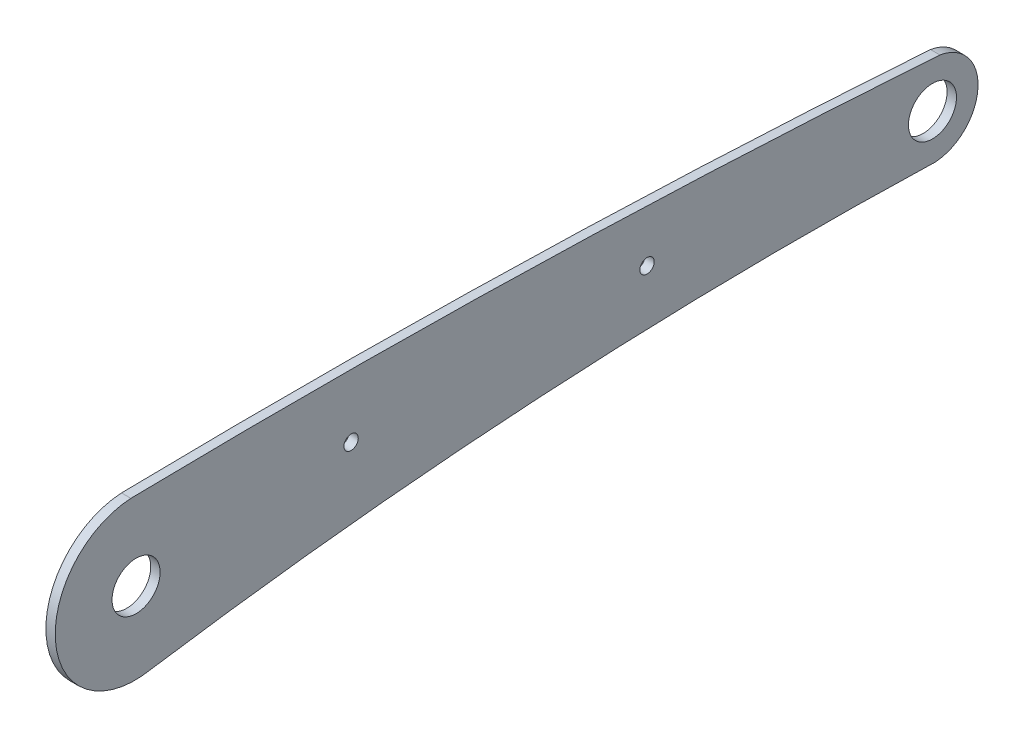
ISO-10303-21;
HEADER;
FILE_DESCRIPTION(('STEP AP214'),'2;1');
FILE_NAME('part.step','',(''),(''),'','','');
FILE_SCHEMA(('AUTOMOTIVE_DESIGN { 1 0 10303 214 1 1 1 1 }'));
ENDSEC;
DATA;
#1=APPLICATION_CONTEXT('core data for automotive mechanical design processes');
#2=APPLICATION_PROTOCOL_DEFINITION('international standard','automotive_design',2000,#1);
#3=PRODUCT_CONTEXT('',#1,'mechanical');
#4=PRODUCT('Part','Part','',(#3));
#5=PRODUCT_RELATED_PRODUCT_CATEGORY('part','',(#4));
#6=PRODUCT_DEFINITION_FORMATION('','',#4);
#7=PRODUCT_DEFINITION_CONTEXT('part definition',#1,'design');
#8=PRODUCT_DEFINITION('design','',#6,#7);
#9=PRODUCT_DEFINITION_SHAPE('','',#8);
#10=(LENGTH_UNIT() NAMED_UNIT(*) SI_UNIT(.MILLI.,.METRE.));
#11=(NAMED_UNIT(*) PLANE_ANGLE_UNIT() SI_UNIT($,.RADIAN.));
#12=(NAMED_UNIT(*) SI_UNIT($,.STERADIAN.) SOLID_ANGLE_UNIT());
#13=UNCERTAINTY_MEASURE_WITH_UNIT(LENGTH_MEASURE(1.E-05),#10,'distance_accuracy_value','');
#14=(GEOMETRIC_REPRESENTATION_CONTEXT(3) GLOBAL_UNCERTAINTY_ASSIGNED_CONTEXT((#13)) GLOBAL_UNIT_ASSIGNED_CONTEXT((#10,
#11,#12)) REPRESENTATION_CONTEXT('',''));
#15=CARTESIAN_POINT('',(0.,0.,0.));
#16=DIRECTION('',(0.,0.,1.));
#17=DIRECTION('',(1.,0.,0.));
#18=AXIS2_PLACEMENT_3D('',#15,#16,#17);
#19=CARTESIAN_POINT('',(1.5,0.0065204226326564,-66.7586301230406));
#20=DIRECTION('',(1.,0.,0.));
#21=DIRECTION('',(0.,0.,-1.));
#22=AXIS2_PLACEMENT_3D('',#19,#20,#21);
#23=PLANE('',#22);
#24=CARTESIAN_POINT('',(1.5,3.57117752441619,-20.8921029200437));
#25=DIRECTION('',(1.,0.,0.));
#26=DIRECTION('',(0.,0.,-1.));
#27=AXIS2_PLACEMENT_3D('',#24,#25,#26);
#28=CIRCLE('',#27,1.14903100774873);
#29=CARTESIAN_POINT('',(1.5,3.57117752441619,-22.0411339277924));
#30=VERTEX_POINT('',#29);
#31=EDGE_CURVE('E172',#30,#30,#28,.T.);
#32=ORIENTED_EDGE('',*,*,#31,.F.);
#33=EDGE_LOOP('',(#32));
#34=FACE_BOUND('',#33,.T.);
#35=CARTESIAN_POINT('',(1.5,2.1615708798249,-66.6171405395635));
#36=DIRECTION('',(1.,0.,0.));
#37=DIRECTION('',(0.,0.,-1.));
#38=AXIS2_PLACEMENT_3D('',#35,#36,#37);
#39=CIRCLE('',#38,3.85000000000001);
#40=CARTESIAN_POINT('',(1.5,2.1615708798249,-70.4671405395635));
#41=VERTEX_POINT('',#40);
#42=EDGE_CURVE('E112',#41,#41,#39,.T.);
#43=ORIENTED_EDGE('',*,*,#42,.F.);
#44=EDGE_LOOP('',(#43));
#45=FACE_BOUND('',#44,.T.);
#46=CARTESIAN_POINT('',(1.5,-2.14853003455959,-66.9001197065177));
#47=DIRECTION('',(1.,0.,0.));
#48=DIRECTION('',(0.,0.,-1.));
#49=AXIS2_PLACEMENT_3D('',#46,#47,#48);
#50=CIRCLE('',#49,2.9844961240227);
#51=CARTESIAN_POINT('',(1.5,-5.11662723586404,-66.5876839244522));
#52=VERTEX_POINT('',#51);
#53=CARTESIAN_POINT('',(1.5,-5.12661444963508,-67.095645487384));
#54=VERTEX_POINT('',#53);
#55=EDGE_CURVE('E117',#52,#54,#50,.T.);
#56=ORIENTED_EDGE('',*,*,#55,.T.);
#57=CARTESIAN_POINT('',(1.5,2.1615708798249,-66.6171405395635));
#58=DIRECTION('',(1.,0.,0.));
#59=DIRECTION('',(0.,0.,-1.));
#60=AXIS2_PLACEMENT_3D('',#57,#58,#59);
#61=CIRCLE('',#60,7.30387653110624);
#62=CARTESIAN_POINT('',(1.5,9.36927454105452,-67.7985042911333));
#63=VERTEX_POINT('',#62);
#64=EDGE_CURVE('E84',#54,#63,#61,.T.);
#65=ORIENTED_EDGE('',*,*,#64,.T.);
#66=CARTESIAN_POINT('',(1.5,-1440.36136953038,33.8038491519962));
#67=DIRECTION('',(1.,0.,0.));
#68=DIRECTION('',(0.,0.,-1.));
#69=AXIS2_PLACEMENT_3D('',#66,#67,#68);
#70=CIRCLE('',#69,1453.28661267658);
#71=CARTESIAN_POINT('',(1.5,12.6554814310781,61.8040171337543));
#72=VERTEX_POINT('',#71);
#73=EDGE_CURVE('E88',#63,#72,#70,.T.);
#74=ORIENTED_EDGE('',*,*,#73,.T.);
#75=CARTESIAN_POINT('',(1.5,-0.125777128901056,61.1215510533747));
#76=DIRECTION('',(1.,0.,0.));
#77=DIRECTION('',(0.,0.,-1.));
#78=AXIS2_PLACEMENT_3D('',#75,#76,#77);
#79=CIRCLE('',#78,12.7994660172957);
#80=CARTESIAN_POINT('',(1.5,-12.681082443716,58.6334516221455));
#81=VERTEX_POINT('',#80);
#82=EDGE_CURVE('E92',#72,#81,#79,.T.);
#83=ORIENTED_EDGE('',*,*,#82,.T.);
#84=CARTESIAN_POINT('',(1.5,-695.689726778049,-45.4653103386699));
#85=DIRECTION('',(-1.,0.,0.));
#86=DIRECTION('',(0.,0.,-1.));
#87=AXIS2_PLACEMENT_3D('',#84,#85,#86);
#88=CIRCLE('',#87,690.896056203245);
#89=EDGE_CURVE('E50',#81,#52,#88,.T.);
#90=ORIENTED_EDGE('',*,*,#89,.T.);
#91=EDGE_LOOP('',(#56,#65,#74,#83,#90));
#92=FACE_BOUND('',#91,.T.);
#93=CARTESIAN_POINT('',(1.5,0.0795854792217612,60.9696633130141));
#94=DIRECTION('',(1.,0.,0.));
#95=DIRECTION('',(0.,0.,-1.));
#96=AXIS2_PLACEMENT_3D('',#93,#94,#95);
#97=CIRCLE('',#96,3.85);
#98=CARTESIAN_POINT('',(1.5,0.0795854792217612,57.1196633130141));
#99=VERTEX_POINT('',#98);
#100=EDGE_CURVE('E178',#99,#99,#97,.T.);
#101=ORIENTED_EDGE('',*,*,#100,.F.);
#102=EDGE_LOOP('',(#101));
#103=FACE_BOUND('',#102,.T.);
#104=CARTESIAN_POINT('',(1.5,2.79746673365068,26.5219120251684));
#105=DIRECTION('',(1.,0.,0.));
#106=DIRECTION('',(0.,0.,-1.));
#107=AXIS2_PLACEMENT_3D('',#104,#105,#106);
#108=CIRCLE('',#107,1.14903100774873);
#109=CARTESIAN_POINT('',(1.5,2.79746673365068,25.3728810174197));
#110=VERTEX_POINT('',#109);
#111=EDGE_CURVE('E163',#110,#110,#108,.T.);
#112=ORIENTED_EDGE('',*,*,#111,.F.);
#113=EDGE_LOOP('',(#112));
#114=FACE_BOUND('',#113,.T.);
#115=ADVANCED_FACE('F33',(#34,#45,#92,#103,#114),#23,.T.);
#116=CARTESIAN_POINT('',(0.,0.0065204226326564,-66.7586301230406));
#117=DIRECTION('',(1.,0.,0.));
#118=DIRECTION('',(0.,0.,-1.));
#119=AXIS2_PLACEMENT_3D('',#116,#117,#118);
#120=PLANE('',#119);
#121=CARTESIAN_POINT('',(0.,-2.14853003455959,-66.9001197065177));
#122=DIRECTION('',(1.,0.,0.));
#123=DIRECTION('',(0.,0.,-1.));
#124=AXIS2_PLACEMENT_3D('',#121,#122,#123);
#125=CIRCLE('',#124,2.9844961240227);
#126=CARTESIAN_POINT('',(0.,-5.11662723586404,-66.5876839244522));
#127=VERTEX_POINT('',#126);
#128=CARTESIAN_POINT('',(0.,-5.12661444963508,-67.095645487384));
#129=VERTEX_POINT('',#128);
#130=EDGE_CURVE('E108',#127,#129,#125,.T.);
#131=ORIENTED_EDGE('',*,*,#130,.F.);
#132=CARTESIAN_POINT('',(0.,-695.689726778049,-45.4653103386699));
#133=DIRECTION('',(-1.,0.,0.));
#134=DIRECTION('',(0.,0.,-1.));
#135=AXIS2_PLACEMENT_3D('',#132,#133,#134);
#136=CIRCLE('',#135,690.896056203245);
#137=CARTESIAN_POINT('',(0.,-12.681082443716,58.6334516221455));
#138=VERTEX_POINT('',#137);
#139=EDGE_CURVE('E76',#138,#127,#136,.T.);
#140=ORIENTED_EDGE('',*,*,#139,.F.);
#141=CARTESIAN_POINT('',(0.,-0.125777128901056,61.1215510533747));
#142=DIRECTION('',(1.,0.,0.));
#143=DIRECTION('',(0.,0.,-1.));
#144=AXIS2_PLACEMENT_3D('',#141,#142,#143);
#145=CIRCLE('',#144,12.7994660172957);
#146=CARTESIAN_POINT('',(0.,12.6554814310781,61.8040171337543));
#147=VERTEX_POINT('',#146);
#148=EDGE_CURVE('E70',#147,#138,#145,.T.);
#149=ORIENTED_EDGE('',*,*,#148,.F.);
#150=CARTESIAN_POINT('',(0.,-1440.36136953038,33.8038491519962));
#151=DIRECTION('',(1.,0.,0.));
#152=DIRECTION('',(0.,0.,-1.));
#153=AXIS2_PLACEMENT_3D('',#150,#151,#152);
#154=CIRCLE('',#153,1453.28661267658);
#155=CARTESIAN_POINT('',(0.,9.36927454105452,-67.7985042911333));
#156=VERTEX_POINT('',#155);
#157=EDGE_CURVE('E99',#156,#147,#154,.T.);
#158=ORIENTED_EDGE('',*,*,#157,.F.);
#159=CARTESIAN_POINT('',(0.,2.1615708798249,-66.6171405395635));
#160=DIRECTION('',(1.,0.,0.));
#161=DIRECTION('',(0.,0.,-1.));
#162=AXIS2_PLACEMENT_3D('',#159,#160,#161);
#163=CIRCLE('',#162,7.30387653110624);
#164=EDGE_CURVE('E111',#129,#156,#163,.T.);
#165=ORIENTED_EDGE('',*,*,#164,.F.);
#166=EDGE_LOOP('',(#131,#140,#149,#158,#165));
#167=FACE_BOUND('',#166,.T.);
#168=CARTESIAN_POINT('',(0.,2.1615708798249,-66.6171405395635));
#169=DIRECTION('',(1.,0.,0.));
#170=DIRECTION('',(0.,0.,-1.));
#171=AXIS2_PLACEMENT_3D('',#168,#169,#170);
#172=CIRCLE('',#171,3.85000000000001);
#173=CARTESIAN_POINT('',(0.,2.1615708798249,-70.4671405395635));
#174=VERTEX_POINT('',#173);
#175=EDGE_CURVE('E181',#174,#174,#172,.T.);
#176=ORIENTED_EDGE('',*,*,#175,.T.);
#177=EDGE_LOOP('',(#176));
#178=FACE_BOUND('',#177,.T.);
#179=CARTESIAN_POINT('',(0.,0.0795854792217612,60.9696633130141));
#180=DIRECTION('',(1.,0.,0.));
#181=DIRECTION('',(0.,0.,-1.));
#182=AXIS2_PLACEMENT_3D('',#179,#180,#181);
#183=CIRCLE('',#182,3.85);
#184=CARTESIAN_POINT('',(0.,0.0795854792217612,57.1196633130141));
#185=VERTEX_POINT('',#184);
#186=EDGE_CURVE('E175',#185,#185,#183,.T.);
#187=ORIENTED_EDGE('',*,*,#186,.T.);
#188=EDGE_LOOP('',(#187));
#189=FACE_BOUND('',#188,.T.);
#190=CARTESIAN_POINT('',(0.,3.57117752441619,-20.8921029200437));
#191=DIRECTION('',(1.,0.,0.));
#192=DIRECTION('',(0.,0.,-1.));
#193=AXIS2_PLACEMENT_3D('',#190,#191,#192);
#194=CIRCLE('',#193,1.14903100774873);
#195=CARTESIAN_POINT('',(0.,3.57117752441619,-22.0411339277924));
#196=VERTEX_POINT('',#195);
#197=EDGE_CURVE('E169',#196,#196,#194,.T.);
#198=ORIENTED_EDGE('',*,*,#197,.T.);
#199=EDGE_LOOP('',(#198));
#200=FACE_BOUND('',#199,.T.);
#201=CARTESIAN_POINT('',(0.,2.79746673365068,26.5219120251684));
#202=DIRECTION('',(1.,0.,0.));
#203=DIRECTION('',(0.,0.,-1.));
#204=AXIS2_PLACEMENT_3D('',#201,#202,#203);
#205=CIRCLE('',#204,1.14903100774873);
#206=CARTESIAN_POINT('',(0.,2.79746673365068,25.3728810174197));
#207=VERTEX_POINT('',#206);
#208=EDGE_CURVE('E166',#207,#207,#205,.T.);
#209=ORIENTED_EDGE('',*,*,#208,.T.);
#210=EDGE_LOOP('',(#209));
#211=FACE_BOUND('',#210,.T.);
#212=ADVANCED_FACE('F121',(#167,#178,#189,#200,#211),#120,.F.);
#213=CARTESIAN_POINT('',(1.5,-2.14853003455959,-66.9001197065177));
#214=DIRECTION('',(-1.,0.,0.));
#215=DIRECTION('',(0.,0.,1.));
#216=AXIS2_PLACEMENT_3D('',#213,#214,#215);
#217=CYLINDRICAL_SURFACE('',#216,2.9844961240227);
#218=ORIENTED_EDGE('',*,*,#130,.T.);
#219=DIRECTION('',(-1.,0.,0.));
#220=VECTOR('',#219,1.);
#221=CARTESIAN_POINT('',(1.5,-5.12661444963508,-67.095645487384));
#222=LINE('',#221,#220);
#223=EDGE_CURVE('E11',#54,#129,#222,.T.);
#224=ORIENTED_EDGE('',*,*,#223,.F.);
#225=ORIENTED_EDGE('',*,*,#55,.F.);
#226=DIRECTION('',(-1.,0.,0.));
#227=VECTOR('',#226,1.);
#228=CARTESIAN_POINT('',(1.5,-5.11662723586404,-66.5876839244522));
#229=LINE('',#228,#227);
#230=EDGE_CURVE('E104',#52,#127,#229,.T.);
#231=ORIENTED_EDGE('',*,*,#230,.T.);
#232=EDGE_LOOP('',(#218,#224,#225,#231));
#233=FACE_BOUND('',#232,.T.);
#234=ADVANCED_FACE('F35',(#233),#217,.T.);
#235=CARTESIAN_POINT('',(1.5,2.1615708798249,-66.6171405395635));
#236=DIRECTION('',(-1.,0.,0.));
#237=DIRECTION('',(0.,0.,1.));
#238=AXIS2_PLACEMENT_3D('',#235,#236,#237);
#239=CYLINDRICAL_SURFACE('',#238,7.30387653110624);
#240=ORIENTED_EDGE('',*,*,#164,.T.);
#241=DIRECTION('',(-1.,0.,0.));
#242=VECTOR('',#241,1.);
#243=CARTESIAN_POINT('',(1.5,9.36927454105452,-67.7985042911333));
#244=LINE('',#243,#242);
#245=EDGE_CURVE('E42',#63,#156,#244,.T.);
#246=ORIENTED_EDGE('',*,*,#245,.F.);
#247=ORIENTED_EDGE('',*,*,#64,.F.);
#248=ORIENTED_EDGE('',*,*,#223,.T.);
#249=EDGE_LOOP('',(#240,#246,#247,#248));
#250=FACE_BOUND('',#249,.T.);
#251=ADVANCED_FACE('F230',(#250),#239,.T.);
#252=CARTESIAN_POINT('',(1.5,-1440.36136953038,33.8038491519962));
#253=DIRECTION('',(-1.,0.,0.));
#254=DIRECTION('',(0.,0.,1.));
#255=AXIS2_PLACEMENT_3D('',#252,#253,#254);
#256=CYLINDRICAL_SURFACE('',#255,1453.28661267658);
#257=ORIENTED_EDGE('',*,*,#157,.T.);
#258=DIRECTION('',(-1.,0.,0.));
#259=VECTOR('',#258,1.);
#260=CARTESIAN_POINT('',(1.5,12.6554814310781,61.8040171337543));
#261=LINE('',#260,#259);
#262=EDGE_CURVE('E96',#72,#147,#261,.T.);
#263=ORIENTED_EDGE('',*,*,#262,.F.);
#264=ORIENTED_EDGE('',*,*,#73,.F.);
#265=ORIENTED_EDGE('',*,*,#245,.T.);
#266=EDGE_LOOP('',(#257,#263,#264,#265));
#267=FACE_BOUND('',#266,.T.);
#268=ADVANCED_FACE('F97',(#267),#256,.T.);
#269=CARTESIAN_POINT('',(1.5,-0.125777128901056,61.1215510533747));
#270=DIRECTION('',(-1.,0.,0.));
#271=DIRECTION('',(0.,0.,1.));
#272=AXIS2_PLACEMENT_3D('',#269,#270,#271);
#273=CYLINDRICAL_SURFACE('',#272,12.7994660172957);
#274=ORIENTED_EDGE('',*,*,#148,.T.);
#275=DIRECTION('',(-1.,0.,0.));
#276=VECTOR('',#275,1.);
#277=CARTESIAN_POINT('',(1.5,-12.681082443716,58.6334516221455));
#278=LINE('',#277,#276);
#279=EDGE_CURVE('E100',#81,#138,#278,.T.);
#280=ORIENTED_EDGE('',*,*,#279,.F.);
#281=ORIENTED_EDGE('',*,*,#82,.F.);
#282=ORIENTED_EDGE('',*,*,#262,.T.);
#283=EDGE_LOOP('',(#274,#280,#281,#282));
#284=FACE_BOUND('',#283,.T.);
#285=ADVANCED_FACE('F102',(#284),#273,.T.);
#286=CARTESIAN_POINT('',(1.5,-695.689726778049,-45.4653103386699));
#287=DIRECTION('',(-1.,0.,0.));
#288=DIRECTION('',(0.,0.,1.));
#289=AXIS2_PLACEMENT_3D('',#286,#287,#288);
#290=CYLINDRICAL_SURFACE('',#289,690.896056203245);
#291=ORIENTED_EDGE('',*,*,#139,.T.);
#292=ORIENTED_EDGE('',*,*,#230,.F.);
#293=ORIENTED_EDGE('',*,*,#89,.F.);
#294=ORIENTED_EDGE('',*,*,#279,.T.);
#295=EDGE_LOOP('',(#291,#292,#293,#294));
#296=FACE_BOUND('',#295,.T.);
#297=ADVANCED_FACE('F126',(#296),#290,.F.);
#298=CARTESIAN_POINT('',(1.5,2.1615708798249,-66.6171405395635));
#299=DIRECTION('',(-1.,0.,0.));
#300=DIRECTION('',(0.,0.,1.));
#301=AXIS2_PLACEMENT_3D('',#298,#299,#300);
#302=CYLINDRICAL_SURFACE('',#301,3.85000000000001);
#303=ORIENTED_EDGE('',*,*,#42,.T.);
#304=EDGE_LOOP('',(#303));
#305=FACE_BOUND('',#304,.T.);
#306=ORIENTED_EDGE('',*,*,#175,.F.);
#307=EDGE_LOOP('',(#306));
#308=FACE_BOUND('',#307,.T.);
#309=ADVANCED_FACE('F128',(#305,#308),#302,.F.);
#310=CARTESIAN_POINT('',(1.5,0.0795854792217612,60.9696633130141));
#311=DIRECTION('',(-1.,0.,0.));
#312=DIRECTION('',(0.,0.,1.));
#313=AXIS2_PLACEMENT_3D('',#310,#311,#312);
#314=CYLINDRICAL_SURFACE('',#313,3.85);
#315=ORIENTED_EDGE('',*,*,#100,.T.);
#316=EDGE_LOOP('',(#315));
#317=FACE_BOUND('',#316,.T.);
#318=ORIENTED_EDGE('',*,*,#186,.F.);
#319=EDGE_LOOP('',(#318));
#320=FACE_BOUND('',#319,.T.);
#321=ADVANCED_FACE('F134',(#317,#320),#314,.F.);
#322=CARTESIAN_POINT('',(1.5,3.57117752441619,-20.8921029200437));
#323=DIRECTION('',(-1.,0.,0.));
#324=DIRECTION('',(0.,0.,1.));
#325=AXIS2_PLACEMENT_3D('',#322,#323,#324);
#326=CYLINDRICAL_SURFACE('',#325,1.14903100774873);
#327=ORIENTED_EDGE('',*,*,#31,.T.);
#328=EDGE_LOOP('',(#327));
#329=FACE_BOUND('',#328,.T.);
#330=ORIENTED_EDGE('',*,*,#197,.F.);
#331=EDGE_LOOP('',(#330));
#332=FACE_BOUND('',#331,.T.);
#333=ADVANCED_FACE('F150',(#329,#332),#326,.F.);
#334=CARTESIAN_POINT('',(1.5,2.79746673365068,26.5219120251684));
#335=DIRECTION('',(-1.,0.,0.));
#336=DIRECTION('',(0.,0.,1.));
#337=AXIS2_PLACEMENT_3D('',#334,#335,#336);
#338=CYLINDRICAL_SURFACE('',#337,1.14903100774873);
#339=ORIENTED_EDGE('',*,*,#111,.T.);
#340=EDGE_LOOP('',(#339));
#341=FACE_BOUND('',#340,.T.);
#342=ORIENTED_EDGE('',*,*,#208,.F.);
#343=EDGE_LOOP('',(#342));
#344=FACE_BOUND('',#343,.T.);
#345=ADVANCED_FACE('F154',(#341,#344),#338,.F.);
#346=CLOSED_SHELL('',(#115,#212,#234,#251,#268,#285,#297,#309,#321,#333,#345));
#347=MANIFOLD_SOLID_BREP('B2',#346);
#348=ADVANCED_BREP_SHAPE_REPRESENTATION('',(#18,#347),#14);
#349=SHAPE_DEFINITION_REPRESENTATION(#9,#348);
ENDSEC;
END-ISO-10303-21;
